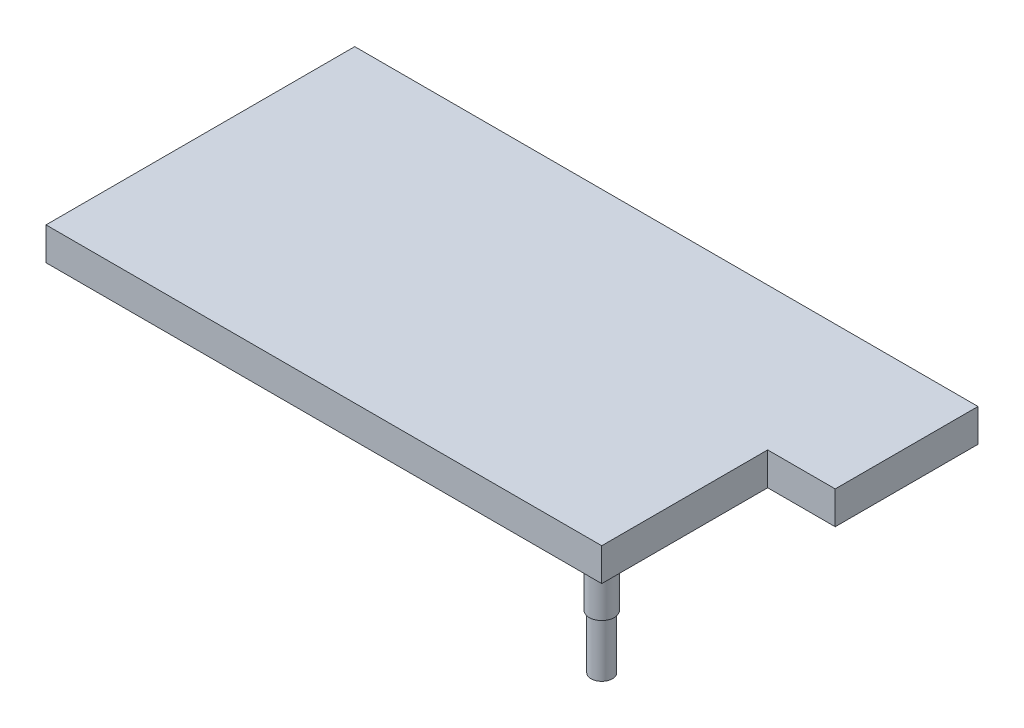
ISO-10303-21;
HEADER;
FILE_DESCRIPTION(('STEP AP214'),'2;1');
FILE_NAME('part.step','',(''),(''),'','','');
FILE_SCHEMA(('AUTOMOTIVE_DESIGN { 1 0 10303 214 1 1 1 1 }'));
ENDSEC;
DATA;
#1=APPLICATION_CONTEXT('core data for automotive mechanical design processes');
#2=APPLICATION_PROTOCOL_DEFINITION('international standard','automotive_design',2000,#1);
#3=PRODUCT_CONTEXT('',#1,'mechanical');
#4=PRODUCT('Part','Part','',(#3));
#5=PRODUCT_RELATED_PRODUCT_CATEGORY('part','',(#4));
#6=PRODUCT_DEFINITION_FORMATION('','',#4);
#7=PRODUCT_DEFINITION_CONTEXT('part definition',#1,'design');
#8=PRODUCT_DEFINITION('design','',#6,#7);
#9=PRODUCT_DEFINITION_SHAPE('','',#8);
#10=(LENGTH_UNIT() NAMED_UNIT(*) SI_UNIT(.MILLI.,.METRE.));
#11=(NAMED_UNIT(*) PLANE_ANGLE_UNIT() SI_UNIT($,.RADIAN.));
#12=(NAMED_UNIT(*) SI_UNIT($,.STERADIAN.) SOLID_ANGLE_UNIT());
#13=UNCERTAINTY_MEASURE_WITH_UNIT(LENGTH_MEASURE(1.E-05),#10,'distance_accuracy_value','');
#14=(GEOMETRIC_REPRESENTATION_CONTEXT(3) GLOBAL_UNCERTAINTY_ASSIGNED_CONTEXT((#13)) GLOBAL_UNIT_ASSIGNED_CONTEXT((#10,
#11,#12)) REPRESENTATION_CONTEXT('',''));
#15=CARTESIAN_POINT('',(0.,0.,0.));
#16=DIRECTION('',(0.,0.,1.));
#17=DIRECTION('',(1.,0.,0.));
#18=AXIS2_PLACEMENT_3D('',#15,#16,#17);
#19=CARTESIAN_POINT('',(-25.4,-115.8875,-25.4));
#20=DIRECTION('',(0.,-1.,0.));
#21=DIRECTION('',(0.,0.,-1.));
#22=AXIS2_PLACEMENT_3D('',#19,#20,#21);
#23=PLANE('',#22);
#24=CARTESIAN_POINT('',(-25.4,-115.8875,-25.4));
#25=DIRECTION('',(0.,-1.,0.));
#26=DIRECTION('',(0.,0.,-1.));
#27=AXIS2_PLACEMENT_3D('',#24,#25,#26);
#28=CIRCLE('',#27,20.6375);
#29=CARTESIAN_POINT('',(-25.4,-115.8875,-46.0375));
#30=VERTEX_POINT('',#29);
#31=EDGE_CURVE('E11',#30,#30,#28,.T.);
#32=ORIENTED_EDGE('',*,*,#31,.T.);
#33=EDGE_LOOP('',(#32));
#34=FACE_BOUND('',#33,.T.);
#35=CARTESIAN_POINT('',(-25.4,-115.8875,-25.4));
#36=DIRECTION('',(0.,-1.,0.));
#37=DIRECTION('',(0.,0.,-1.));
#38=AXIS2_PLACEMENT_3D('',#35,#36,#37);
#39=CIRCLE('',#38,17.4625);
#40=CARTESIAN_POINT('',(-25.4,-115.8875,-42.8625));
#41=VERTEX_POINT('',#40);
#42=EDGE_CURVE('E51',#41,#41,#39,.T.);
#43=ORIENTED_EDGE('',*,*,#42,.F.);
#44=EDGE_LOOP('',(#43));
#45=FACE_BOUND('',#44,.T.);
#46=ADVANCED_FACE('F40',(#34,#45),#23,.T.);
#47=CARTESIAN_POINT('',(-25.4,-52.3875,-25.4));
#48=DIRECTION('',(0.,-1.,0.));
#49=DIRECTION('',(0.,0.,-1.));
#50=AXIS2_PLACEMENT_3D('',#47,#48,#49);
#51=PLANE('',#50);
#52=CARTESIAN_POINT('',(-25.4,-52.3875,-25.4));
#53=DIRECTION('',(0.,-1.,0.));
#54=DIRECTION('',(0.,0.,-1.));
#55=AXIS2_PLACEMENT_3D('',#52,#53,#54);
#56=CIRCLE('',#55,20.6375);
#57=CARTESIAN_POINT('',(-25.4,-52.3875,-46.0375));
#58=VERTEX_POINT('',#57);
#59=EDGE_CURVE('E44',#58,#58,#56,.T.);
#60=ORIENTED_EDGE('',*,*,#59,.F.);
#61=EDGE_LOOP('',(#60));
#62=FACE_BOUND('',#61,.T.);
#63=CARTESIAN_POINT('',(-25.4,-52.3875,-25.4));
#64=DIRECTION('',(0.,-1.,0.));
#65=DIRECTION('',(0.,0.,-1.));
#66=AXIS2_PLACEMENT_3D('',#63,#64,#65);
#67=CIRCLE('',#66,17.4625);
#68=CARTESIAN_POINT('',(-25.4,-52.3875,-42.8625));
#69=VERTEX_POINT('',#68);
#70=EDGE_CURVE('E53',#69,#69,#67,.T.);
#71=ORIENTED_EDGE('',*,*,#70,.T.);
#72=EDGE_LOOP('',(#71));
#73=FACE_BOUND('',#72,.T.);
#74=ADVANCED_FACE('F63',(#62,#73),#51,.F.);
#75=CARTESIAN_POINT('',(-25.4,-115.8875,-25.4));
#76=DIRECTION('',(0.,1.,0.));
#77=DIRECTION('',(0.,0.,1.));
#78=AXIS2_PLACEMENT_3D('',#75,#76,#77);
#79=CYLINDRICAL_SURFACE('',#78,20.6375);
#80=ORIENTED_EDGE('',*,*,#31,.F.);
#81=EDGE_LOOP('',(#80));
#82=FACE_BOUND('',#81,.T.);
#83=ORIENTED_EDGE('',*,*,#59,.T.);
#84=EDGE_LOOP('',(#83));
#85=FACE_BOUND('',#84,.T.);
#86=ADVANCED_FACE('F42',(#82,#85),#79,.T.);
#87=CARTESIAN_POINT('',(-25.4,-115.8875,-25.4));
#88=DIRECTION('',(0.,1.,0.));
#89=DIRECTION('',(0.,0.,1.));
#90=AXIS2_PLACEMENT_3D('',#87,#88,#89);
#91=CYLINDRICAL_SURFACE('',#90,17.4625);
#92=ORIENTED_EDGE('',*,*,#42,.T.);
#93=EDGE_LOOP('',(#92));
#94=FACE_BOUND('',#93,.T.);
#95=ORIENTED_EDGE('',*,*,#70,.F.);
#96=EDGE_LOOP('',(#95));
#97=FACE_BOUND('',#96,.T.);
#98=ADVANCED_FACE('F59',(#94,#97),#91,.F.);
#99=CLOSED_SHELL('',(#46,#74,#86,#98));
#100=MANIFOLD_SOLID_BREP('B2',#99);
#101=CARTESIAN_POINT('',(0.,1.5875,0.));
#102=DIRECTION('',(-1.,0.,0.));
#103=DIRECTION('',(0.,0.,1.));
#104=AXIS2_PLACEMENT_3D('',#101,#102,#103);
#105=PLANE('',#104);
#106=DIRECTION('',(0.,-1.,0.));
#107=VECTOR('',#106,1.);
#108=CARTESIAN_POINT('',(0.,1.58749999999997,-273.05));
#109=LINE('',#108,#107);
#110=CARTESIAN_POINT('',(0.,1.5875,-273.05));
#111=VERTEX_POINT('',#110);
#112=CARTESIAN_POINT('',(0.,-52.3875,-273.05));
#113=VERTEX_POINT('',#112);
#114=EDGE_CURVE('E119',#111,#113,#109,.T.);
#115=ORIENTED_EDGE('',*,*,#114,.F.);
#116=DIRECTION('',(0.,0.,-1.));
#117=VECTOR('',#116,1.);
#118=CARTESIAN_POINT('',(0.,1.5875,0.));
#119=LINE('',#118,#117);
#120=CARTESIAN_POINT('',(0.,1.5875,0.));
#121=VERTEX_POINT('',#120);
#122=EDGE_CURVE('E217',#121,#111,#119,.T.);
#123=ORIENTED_EDGE('',*,*,#122,.F.);
#124=DIRECTION('',(0.,-1.,0.));
#125=VECTOR('',#124,1.);
#126=CARTESIAN_POINT('',(0.,1.5875,0.));
#127=LINE('',#126,#125);
#128=CARTESIAN_POINT('',(0.,-52.3875,0.));
#129=VERTEX_POINT('',#128);
#130=EDGE_CURVE('E269',#121,#129,#127,.T.);
#131=ORIENTED_EDGE('',*,*,#130,.T.);
#132=DIRECTION('',(0.,0.,1.));
#133=VECTOR('',#132,1.);
#134=CARTESIAN_POINT('',(0.,-52.3875,0.));
#135=LINE('',#134,#133);
#136=EDGE_CURVE('E264',#113,#129,#135,.T.);
#137=ORIENTED_EDGE('',*,*,#136,.F.);
#138=EDGE_LOOP('',(#115,#123,#131,#137));
#139=FACE_BOUND('',#138,.T.);
#140=ADVANCED_FACE('F102',(#139),#105,.F.);
#141=CARTESIAN_POINT('',(0.,-52.3875,0.));
#142=DIRECTION('',(0.,-1.,0.));
#143=DIRECTION('',(0.,0.,-1.));
#144=AXIS2_PLACEMENT_3D('',#141,#142,#143);
#145=PLANE('',#144);
#146=DIRECTION('',(0.,0.,-1.));
#147=VECTOR('',#146,1.);
#148=CARTESIAN_POINT('',(-863.6,-52.3875,-50.8));
#149=LINE('',#148,#147);
#150=CARTESIAN_POINT('',(-863.6,-52.3875,-50.8));
#151=VERTEX_POINT('',#150);
#152=CARTESIAN_POINT('',(-863.6,-52.3875,-457.2));
#153=VERTEX_POINT('',#152);
#154=EDGE_CURVE('E233',#151,#153,#149,.T.);
#155=ORIENTED_EDGE('',*,*,#154,.F.);
#156=DIRECTION('',(-1.,0.,0.));
#157=VECTOR('',#156,1.);
#158=CARTESIAN_POINT('',(-50.8,-52.3875,-50.8));
#159=LINE('',#158,#157);
#160=CARTESIAN_POINT('',(-50.8,-52.3875,-50.8));
#161=VERTEX_POINT('',#160);
#162=EDGE_CURVE('E231',#161,#151,#159,.T.);
#163=ORIENTED_EDGE('',*,*,#162,.F.);
#164=DIRECTION('',(0.,0.,1.));
#165=VECTOR('',#164,1.);
#166=CARTESIAN_POINT('',(-50.8,-52.3875,-50.8));
#167=LINE('',#166,#165);
#168=CARTESIAN_POINT('',(-50.8,-52.3875,-457.2));
#169=VERTEX_POINT('',#168);
#170=EDGE_CURVE('E239',#169,#161,#167,.T.);
#171=ORIENTED_EDGE('',*,*,#170,.F.);
#172=DIRECTION('',(1.,0.,0.));
#173=VECTOR('',#172,1.);
#174=CARTESIAN_POINT('',(-863.6,-52.3875,-457.2));
#175=LINE('',#174,#173);
#176=EDGE_CURVE('E236',#153,#169,#175,.T.);
#177=ORIENTED_EDGE('',*,*,#176,.F.);
#178=EDGE_LOOP('',(#155,#163,#171,#177));
#179=FACE_BOUND('',#178,.T.);
#180=DIRECTION('',(0.,0.,-1.));
#181=VECTOR('',#180,1.);
#182=CARTESIAN_POINT('',(-914.4,-52.3875,0.));
#183=LINE('',#182,#181);
#184=CARTESIAN_POINT('',(-914.4,-52.3875,0.));
#185=VERTEX_POINT('',#184);
#186=CARTESIAN_POINT('',(-914.4,-52.3875,-508.));
#187=VERTEX_POINT('',#186);
#188=EDGE_CURVE('E259',#185,#187,#183,.T.);
#189=ORIENTED_EDGE('',*,*,#188,.T.);
#190=DIRECTION('',(1.,0.,0.));
#191=VECTOR('',#190,1.);
#192=CARTESIAN_POINT('',(-914.4,-52.3875,-508.));
#193=LINE('',#192,#191);
#194=CARTESIAN_POINT('',(111.125,-52.3875,-508.));
#195=VERTEX_POINT('',#194);
#196=EDGE_CURVE('E262',#187,#195,#193,.T.);
#197=ORIENTED_EDGE('',*,*,#196,.T.);
#198=DIRECTION('',(0.,0.,-1.));
#199=VECTOR('',#198,1.);
#200=CARTESIAN_POINT('',(111.125,-52.3875,-508.));
#201=LINE('',#200,#199);
#202=CARTESIAN_POINT('',(111.125,-52.3875,-273.05));
#203=VERTEX_POINT('',#202);
#204=EDGE_CURVE('E204',#203,#195,#201,.T.);
#205=ORIENTED_EDGE('',*,*,#204,.F.);
#206=DIRECTION('',(-1.,0.,0.));
#207=VECTOR('',#206,1.);
#208=CARTESIAN_POINT('',(111.125,-52.3875,-273.05));
#209=LINE('',#208,#207);
#210=EDGE_CURVE('E210',#203,#113,#209,.T.);
#211=ORIENTED_EDGE('',*,*,#210,.T.);
#212=ORIENTED_EDGE('',*,*,#136,.T.);
#213=DIRECTION('',(-1.,0.,0.));
#214=VECTOR('',#213,1.);
#215=CARTESIAN_POINT('',(0.,-52.3875,0.));
#216=LINE('',#215,#214);
#217=EDGE_CURVE('E190',#129,#185,#216,.T.);
#218=ORIENTED_EDGE('',*,*,#217,.T.);
#219=EDGE_LOOP('',(#189,#197,#205,#211,#212,#218));
#220=FACE_BOUND('',#219,.T.);
#221=CARTESIAN_POINT('',(-25.4,-52.3875,-25.4));
#222=DIRECTION('',(0.,-1.,0.));
#223=DIRECTION('',(0.,0.,-1.));
#224=AXIS2_PLACEMENT_3D('',#221,#222,#223);
#225=CIRCLE('',#224,17.4625);
#226=CARTESIAN_POINT('',(-25.4,-52.3875,-42.8625));
#227=VERTEX_POINT('',#226);
#228=EDGE_CURVE('E223',#227,#227,#225,.T.);
#229=ORIENTED_EDGE('',*,*,#228,.F.);
#230=EDGE_LOOP('',(#229));
#231=FACE_BOUND('',#230,.T.);
#232=ADVANCED_FACE('F286',(#179,#220,#231),#145,.T.);
#233=CARTESIAN_POINT('',(-914.4,1.5875,-508.));
#234=DIRECTION('',(0.,0.,1.));
#235=DIRECTION('',(1.,0.,0.));
#236=AXIS2_PLACEMENT_3D('',#233,#234,#235);
#237=PLANE('',#236);
#238=DIRECTION('',(-1.,0.,0.));
#239=VECTOR('',#238,1.);
#240=CARTESIAN_POINT('',(-914.4,1.5875,-508.));
#241=LINE('',#240,#239);
#242=CARTESIAN_POINT('',(111.125,1.5875,-508.));
#243=VERTEX_POINT('',#242);
#244=CARTESIAN_POINT('',(-914.4,1.5875,-508.));
#245=VERTEX_POINT('',#244);
#246=EDGE_CURVE('E183',#243,#245,#241,.T.);
#247=ORIENTED_EDGE('',*,*,#246,.F.);
#248=DIRECTION('',(0.,1.,0.));
#249=VECTOR('',#248,1.);
#250=CARTESIAN_POINT('',(111.125,1.5875,-508.));
#251=LINE('',#250,#249);
#252=EDGE_CURVE('E187',#195,#243,#251,.T.);
#253=ORIENTED_EDGE('',*,*,#252,.F.);
#254=ORIENTED_EDGE('',*,*,#196,.F.);
#255=DIRECTION('',(0.,-1.,0.));
#256=VECTOR('',#255,1.);
#257=CARTESIAN_POINT('',(-914.4,1.5875,-508.));
#258=LINE('',#257,#256);
#259=EDGE_CURVE('E38',#245,#187,#258,.T.);
#260=ORIENTED_EDGE('',*,*,#259,.F.);
#261=EDGE_LOOP('',(#247,#253,#254,#260));
#262=FACE_BOUND('',#261,.T.);
#263=ADVANCED_FACE('F104',(#262),#237,.F.);
#264=CARTESIAN_POINT('',(-914.4,1.5875,0.));
#265=DIRECTION('',(1.,0.,0.));
#266=DIRECTION('',(0.,0.,-1.));
#267=AXIS2_PLACEMENT_3D('',#264,#265,#266);
#268=PLANE('',#267);
#269=ORIENTED_EDGE('',*,*,#259,.T.);
#270=ORIENTED_EDGE('',*,*,#188,.F.);
#271=DIRECTION('',(0.,-1.,0.));
#272=VECTOR('',#271,1.);
#273=CARTESIAN_POINT('',(-914.4,1.5875,0.));
#274=LINE('',#273,#272);
#275=CARTESIAN_POINT('',(-914.4,1.5875,0.));
#276=VERTEX_POINT('',#275);
#277=EDGE_CURVE('E111',#276,#185,#274,.T.);
#278=ORIENTED_EDGE('',*,*,#277,.F.);
#279=DIRECTION('',(0.,0.,1.));
#280=VECTOR('',#279,1.);
#281=CARTESIAN_POINT('',(-914.4,1.5875,0.));
#282=LINE('',#281,#280);
#283=EDGE_CURVE('E189',#245,#276,#282,.T.);
#284=ORIENTED_EDGE('',*,*,#283,.F.);
#285=EDGE_LOOP('',(#269,#270,#278,#284));
#286=FACE_BOUND('',#285,.T.);
#287=ADVANCED_FACE('F280',(#286),#268,.F.);
#288=CARTESIAN_POINT('',(0.,1.5875,0.));
#289=DIRECTION('',(0.,0.,-1.));
#290=DIRECTION('',(-1.,0.,0.));
#291=AXIS2_PLACEMENT_3D('',#288,#289,#290);
#292=PLANE('',#291);
#293=ORIENTED_EDGE('',*,*,#277,.T.);
#294=ORIENTED_EDGE('',*,*,#217,.F.);
#295=ORIENTED_EDGE('',*,*,#130,.F.);
#296=DIRECTION('',(1.,0.,0.));
#297=VECTOR('',#296,1.);
#298=CARTESIAN_POINT('',(0.,1.5875,0.));
#299=LINE('',#298,#297);
#300=EDGE_CURVE('E273',#276,#121,#299,.T.);
#301=ORIENTED_EDGE('',*,*,#300,.F.);
#302=EDGE_LOOP('',(#293,#294,#295,#301));
#303=FACE_BOUND('',#302,.T.);
#304=ADVANCED_FACE('F284',(#303),#292,.F.);
#305=CARTESIAN_POINT('',(0.,1.5875,0.));
#306=DIRECTION('',(0.,1.,0.));
#307=DIRECTION('',(0.,0.,1.));
#308=AXIS2_PLACEMENT_3D('',#305,#306,#307);
#309=PLANE('',#308);
#310=ORIENTED_EDGE('',*,*,#246,.T.);
#311=ORIENTED_EDGE('',*,*,#283,.T.);
#312=ORIENTED_EDGE('',*,*,#300,.T.);
#313=ORIENTED_EDGE('',*,*,#122,.T.);
#314=DIRECTION('',(-1.,0.,0.));
#315=VECTOR('',#314,1.);
#316=CARTESIAN_POINT('',(111.125,1.58749999999997,-273.05));
#317=LINE('',#316,#315);
#318=CARTESIAN_POINT('',(111.125,1.58749999999997,-273.05));
#319=VERTEX_POINT('',#318);
#320=EDGE_CURVE('E196',#319,#111,#317,.T.);
#321=ORIENTED_EDGE('',*,*,#320,.F.);
#322=DIRECTION('',(0.,0.,1.));
#323=VECTOR('',#322,1.);
#324=CARTESIAN_POINT('',(111.125,1.5875,-508.));
#325=LINE('',#324,#323);
#326=EDGE_CURVE('E193',#243,#319,#325,.T.);
#327=ORIENTED_EDGE('',*,*,#326,.F.);
#328=EDGE_LOOP('',(#310,#311,#312,#313,#321,#327));
#329=FACE_BOUND('',#328,.T.);
#330=ADVANCED_FACE('F194',(#329),#309,.T.);
#331=CARTESIAN_POINT('',(-50.8,-52.3875,-50.8));
#332=DIRECTION('',(0.,0.,-1.));
#333=DIRECTION('',(-1.,0.,0.));
#334=AXIS2_PLACEMENT_3D('',#331,#332,#333);
#335=PLANE('',#334);
#336=DIRECTION('',(-1.,0.,0.));
#337=VECTOR('',#336,1.);
#338=CARTESIAN_POINT('',(-50.8,-1.5875,-50.8));
#339=LINE('',#338,#337);
#340=CARTESIAN_POINT('',(-50.8,-1.5875,-50.8));
#341=VERTEX_POINT('',#340);
#342=CARTESIAN_POINT('',(-863.6,-1.5875,-50.8));
#343=VERTEX_POINT('',#342);
#344=EDGE_CURVE('E229',#341,#343,#339,.T.);
#345=ORIENTED_EDGE('',*,*,#344,.F.);
#346=DIRECTION('',(0.,1.,0.));
#347=VECTOR('',#346,1.);
#348=CARTESIAN_POINT('',(-50.8,-52.3875,-50.8));
#349=LINE('',#348,#347);
#350=EDGE_CURVE('E127',#161,#341,#349,.T.);
#351=ORIENTED_EDGE('',*,*,#350,.F.);
#352=ORIENTED_EDGE('',*,*,#162,.T.);
#353=DIRECTION('',(0.,1.,0.));
#354=VECTOR('',#353,1.);
#355=CARTESIAN_POINT('',(-863.6,-52.3875,-50.8));
#356=LINE('',#355,#354);
#357=EDGE_CURVE('E256',#151,#343,#356,.T.);
#358=ORIENTED_EDGE('',*,*,#357,.T.);
#359=EDGE_LOOP('',(#345,#351,#352,#358));
#360=FACE_BOUND('',#359,.T.);
#361=ADVANCED_FACE('F314',(#360),#335,.T.);
#362=CARTESIAN_POINT('',(-863.6,-52.3875,-50.8));
#363=DIRECTION('',(1.,0.,0.));
#364=DIRECTION('',(0.,0.,-1.));
#365=AXIS2_PLACEMENT_3D('',#362,#363,#364);
#366=PLANE('',#365);
#367=DIRECTION('',(0.,0.,-1.));
#368=VECTOR('',#367,1.);
#369=CARTESIAN_POINT('',(-863.6,-1.5875,-50.8));
#370=LINE('',#369,#368);
#371=CARTESIAN_POINT('',(-863.6,-1.5875,-457.2));
#372=VERTEX_POINT('',#371);
#373=EDGE_CURVE('E243',#343,#372,#370,.T.);
#374=ORIENTED_EDGE('',*,*,#373,.F.);
#375=ORIENTED_EDGE('',*,*,#357,.F.);
#376=ORIENTED_EDGE('',*,*,#154,.T.);
#377=DIRECTION('',(0.,1.,0.));
#378=VECTOR('',#377,1.);
#379=CARTESIAN_POINT('',(-863.6,-52.3875,-457.2));
#380=LINE('',#379,#378);
#381=EDGE_CURVE('E254',#153,#372,#380,.T.);
#382=ORIENTED_EDGE('',*,*,#381,.T.);
#383=EDGE_LOOP('',(#374,#375,#376,#382));
#384=FACE_BOUND('',#383,.T.);
#385=ADVANCED_FACE('F400',(#384),#366,.T.);
#386=CARTESIAN_POINT('',(-863.6,-52.3875,-457.2));
#387=DIRECTION('',(0.,0.,1.));
#388=DIRECTION('',(1.,0.,0.));
#389=AXIS2_PLACEMENT_3D('',#386,#387,#388);
#390=PLANE('',#389);
#391=DIRECTION('',(1.,0.,0.));
#392=VECTOR('',#391,1.);
#393=CARTESIAN_POINT('',(-863.6,-1.5875,-457.2));
#394=LINE('',#393,#392);
#395=CARTESIAN_POINT('',(-50.8,-1.5875,-457.2));
#396=VERTEX_POINT('',#395);
#397=EDGE_CURVE('E246',#372,#396,#394,.T.);
#398=ORIENTED_EDGE('',*,*,#397,.F.);
#399=ORIENTED_EDGE('',*,*,#381,.F.);
#400=ORIENTED_EDGE('',*,*,#176,.T.);
#401=DIRECTION('',(0.,1.,0.));
#402=VECTOR('',#401,1.);
#403=CARTESIAN_POINT('',(-50.8,-52.3875,-457.2));
#404=LINE('',#403,#402);
#405=EDGE_CURVE('E252',#169,#396,#404,.T.);
#406=ORIENTED_EDGE('',*,*,#405,.T.);
#407=EDGE_LOOP('',(#398,#399,#400,#406));
#408=FACE_BOUND('',#407,.T.);
#409=ADVANCED_FACE('F391',(#408),#390,.T.);
#410=CARTESIAN_POINT('',(-50.8,-52.3875,-50.8));
#411=DIRECTION('',(-1.,0.,0.));
#412=DIRECTION('',(0.,0.,1.));
#413=AXIS2_PLACEMENT_3D('',#410,#411,#412);
#414=PLANE('',#413);
#415=DIRECTION('',(0.,0.,1.));
#416=VECTOR('',#415,1.);
#417=CARTESIAN_POINT('',(-50.8,-1.5875,-50.8));
#418=LINE('',#417,#416);
#419=EDGE_CURVE('E234',#396,#341,#418,.T.);
#420=ORIENTED_EDGE('',*,*,#419,.F.);
#421=ORIENTED_EDGE('',*,*,#405,.F.);
#422=ORIENTED_EDGE('',*,*,#170,.T.);
#423=ORIENTED_EDGE('',*,*,#350,.T.);
#424=EDGE_LOOP('',(#420,#421,#422,#423));
#425=FACE_BOUND('',#424,.T.);
#426=ADVANCED_FACE('F383',(#425),#414,.T.);
#427=CARTESIAN_POINT('',(0.,-1.5875,0.));
#428=DIRECTION('',(0.,1.,0.));
#429=DIRECTION('',(0.,0.,1.));
#430=AXIS2_PLACEMENT_3D('',#427,#428,#429);
#431=PLANE('',#430);
#432=ORIENTED_EDGE('',*,*,#419,.T.);
#433=ORIENTED_EDGE('',*,*,#344,.T.);
#434=ORIENTED_EDGE('',*,*,#373,.T.);
#435=ORIENTED_EDGE('',*,*,#397,.T.);
#436=EDGE_LOOP('',(#432,#433,#434,#435));
#437=FACE_BOUND('',#436,.T.);
#438=ADVANCED_FACE('F297',(#437),#431,.F.);
#439=CARTESIAN_POINT('',(-25.4,-204.7875,-25.4));
#440=DIRECTION('',(0.,1.,0.));
#441=DIRECTION('',(0.,0.,1.));
#442=AXIS2_PLACEMENT_3D('',#439,#440,#441);
#443=CYLINDRICAL_SURFACE('',#442,17.4625);
#444=CARTESIAN_POINT('',(-25.4,-204.7875,-25.4));
#445=DIRECTION('',(0.,-1.,0.));
#446=DIRECTION('',(0.,0.,-1.));
#447=AXIS2_PLACEMENT_3D('',#444,#445,#446);
#448=CIRCLE('',#447,17.4625);
#449=CARTESIAN_POINT('',(-25.4,-204.7875,-42.8625));
#450=VERTEX_POINT('',#449);
#451=EDGE_CURVE('E213',#450,#450,#448,.T.);
#452=ORIENTED_EDGE('',*,*,#451,.F.);
#453=EDGE_LOOP('',(#452));
#454=FACE_BOUND('',#453,.T.);
#455=ORIENTED_EDGE('',*,*,#228,.T.);
#456=EDGE_LOOP('',(#455));
#457=FACE_BOUND('',#456,.T.);
#458=ADVANCED_FACE('F367',(#454,#457),#443,.T.);
#459=CARTESIAN_POINT('',(-25.4,-204.7875,-25.4));
#460=DIRECTION('',(0.,-1.,0.));
#461=DIRECTION('',(0.,0.,-1.));
#462=AXIS2_PLACEMENT_3D('',#459,#460,#461);
#463=PLANE('',#462);
#464=ORIENTED_EDGE('',*,*,#451,.T.);
#465=EDGE_LOOP('',(#464));
#466=FACE_BOUND('',#465,.T.);
#467=ADVANCED_FACE('F321',(#466),#463,.T.);
#468=CARTESIAN_POINT('',(111.125,1.58749999999997,-273.05));
#469=DIRECTION('',(0.,0.,-1.));
#470=DIRECTION('',(-1.,0.,0.));
#471=AXIS2_PLACEMENT_3D('',#468,#469,#470);
#472=PLANE('',#471);
#473=ORIENTED_EDGE('',*,*,#114,.T.);
#474=ORIENTED_EDGE('',*,*,#210,.F.);
#475=DIRECTION('',(0.,-1.,0.));
#476=VECTOR('',#475,1.);
#477=CARTESIAN_POINT('',(111.125,1.58749999999997,-273.05));
#478=LINE('',#477,#476);
#479=EDGE_CURVE('E199',#319,#203,#478,.T.);
#480=ORIENTED_EDGE('',*,*,#479,.F.);
#481=ORIENTED_EDGE('',*,*,#320,.T.);
#482=EDGE_LOOP('',(#473,#474,#480,#481));
#483=FACE_BOUND('',#482,.T.);
#484=ADVANCED_FACE('F318',(#483),#472,.F.);
#485=CARTESIAN_POINT('',(111.125,0.,0.));
#486=DIRECTION('',(-1.,0.,0.));
#487=DIRECTION('',(0.,0.,1.));
#488=AXIS2_PLACEMENT_3D('',#485,#486,#487);
#489=PLANE('',#488);
#490=ORIENTED_EDGE('',*,*,#252,.T.);
#491=ORIENTED_EDGE('',*,*,#326,.T.);
#492=ORIENTED_EDGE('',*,*,#479,.T.);
#493=ORIENTED_EDGE('',*,*,#204,.T.);
#494=EDGE_LOOP('',(#490,#491,#492,#493));
#495=FACE_BOUND('',#494,.T.);
#496=ADVANCED_FACE('F202',(#495),#489,.F.);
#497=CLOSED_SHELL('',(#140,#232,#263,#287,#304,#330,#361,#385,#409,#426,#438,#458,#467,#484,#496));
#498=MANIFOLD_SOLID_BREP('B6',#497);
#499=ADVANCED_BREP_SHAPE_REPRESENTATION('',(#18,#100,#498),#14);
#500=SHAPE_DEFINITION_REPRESENTATION(#9,#499);
ENDSEC;
END-ISO-10303-21;
